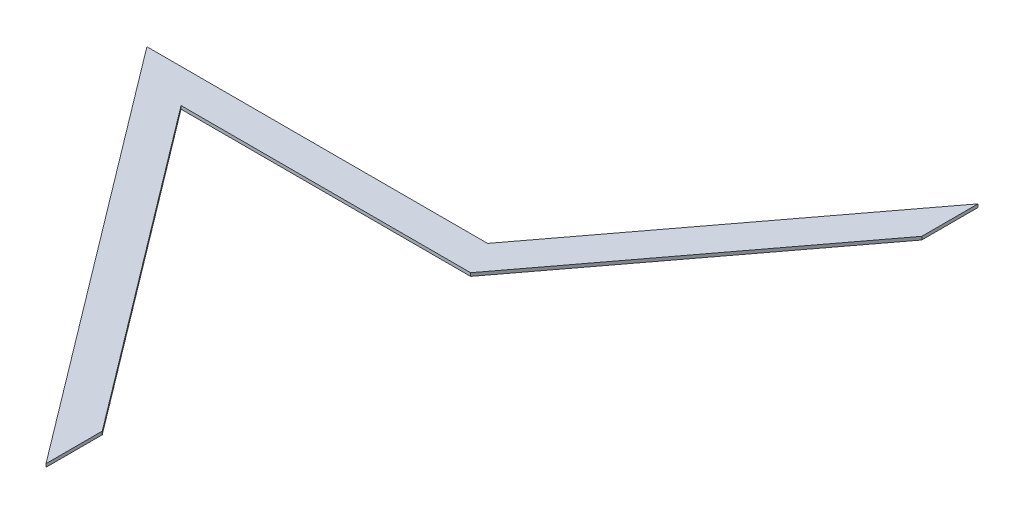
ISO-10303-21;
HEADER;
FILE_DESCRIPTION(('STEP AP214'),'2;1');
FILE_NAME('part.step','',(''),(''),'','','');
FILE_SCHEMA(('AUTOMOTIVE_DESIGN { 1 0 10303 214 1 1 1 1 }'));
ENDSEC;
DATA;
#1=APPLICATION_CONTEXT('core data for automotive mechanical design processes');
#2=APPLICATION_PROTOCOL_DEFINITION('international standard','automotive_design',2000,#1);
#3=PRODUCT_CONTEXT('',#1,'mechanical');
#4=PRODUCT('Part','Part','',(#3));
#5=PRODUCT_RELATED_PRODUCT_CATEGORY('part','',(#4));
#6=PRODUCT_DEFINITION_FORMATION('','',#4);
#7=PRODUCT_DEFINITION_CONTEXT('part definition',#1,'design');
#8=PRODUCT_DEFINITION('design','',#6,#7);
#9=PRODUCT_DEFINITION_SHAPE('','',#8);
#10=(LENGTH_UNIT() NAMED_UNIT(*) SI_UNIT(.MILLI.,.METRE.));
#11=(NAMED_UNIT(*) PLANE_ANGLE_UNIT() SI_UNIT($,.RADIAN.));
#12=(NAMED_UNIT(*) SI_UNIT($,.STERADIAN.) SOLID_ANGLE_UNIT());
#13=UNCERTAINTY_MEASURE_WITH_UNIT(LENGTH_MEASURE(1.E-05),#10,'distance_accuracy_value','');
#14=(GEOMETRIC_REPRESENTATION_CONTEXT(3) GLOBAL_UNCERTAINTY_ASSIGNED_CONTEXT((#13)) GLOBAL_UNIT_ASSIGNED_CONTEXT((#10,
#11,#12)) REPRESENTATION_CONTEXT('',''));
#15=CARTESIAN_POINT('',(0.,0.,0.));
#16=DIRECTION('',(0.,0.,1.));
#17=DIRECTION('',(1.,0.,0.));
#18=AXIS2_PLACEMENT_3D('',#15,#16,#17);
#19=CARTESIAN_POINT('',(74.9994366950103,1.,-214.999999990934));
#20=DIRECTION('',(0.798168151052773,0.,0.602434728949948));
#21=DIRECTION('',(0.602434728949948,0.,-0.798168151052773));
#22=AXIS2_PLACEMENT_3D('',#19,#20,#21);
#23=PLANE('',#22);
#24=DIRECTION('',(-0.602434728949948,0.,0.798168151052773));
#25=VECTOR('',#24,1.);
#26=CARTESIAN_POINT('',(74.9994366950103,0.,-214.999999990934));
#27=LINE('',#26,#25);
#28=CARTESIAN_POINT('',(74.9994366950103,0.,-214.999999990934));
#29=VERTEX_POINT('',#28);
#30=CARTESIAN_POINT('',(9.36449003004114,0.,-128.04));
#31=VERTEX_POINT('',#30);
#32=EDGE_CURVE('E129',#29,#31,#27,.T.);
#33=ORIENTED_EDGE('',*,*,#32,.T.);
#34=DIRECTION('',(0.,-1.,0.));
#35=VECTOR('',#34,1.);
#36=CARTESIAN_POINT('',(9.36449003004114,1.,-128.04));
#37=LINE('',#36,#35);
#38=CARTESIAN_POINT('',(9.36449003004114,1.,-128.04));
#39=VERTEX_POINT('',#38);
#40=EDGE_CURVE('E11',#39,#31,#37,.T.);
#41=ORIENTED_EDGE('',*,*,#40,.F.);
#42=DIRECTION('',(-0.602434728949948,0.,0.798168151052773));
#43=VECTOR('',#42,1.);
#44=CARTESIAN_POINT('',(74.9994366950103,1.,-214.999999990934));
#45=LINE('',#44,#43);
#46=CARTESIAN_POINT('',(74.9994366950103,1.,-214.999999990934));
#47=VERTEX_POINT('',#46);
#48=EDGE_CURVE('E143',#47,#39,#45,.T.);
#49=ORIENTED_EDGE('',*,*,#48,.F.);
#50=DIRECTION('',(0.,-1.,0.));
#51=VECTOR('',#50,1.);
#52=CARTESIAN_POINT('',(74.9994366950103,1.,-214.999999990934));
#53=LINE('',#52,#51);
#54=EDGE_CURVE('E125',#47,#29,#53,.T.);
#55=ORIENTED_EDGE('',*,*,#54,.T.);
#56=EDGE_LOOP('',(#33,#41,#49,#55));
#57=FACE_BOUND('',#56,.T.);
#58=ADVANCED_FACE('F33',(#57),#23,.F.);
#59=CARTESIAN_POINT('',(9.36449003004114,1.,-128.04));
#60=DIRECTION('',(0.,0.,1.));
#61=DIRECTION('',(1.,0.,0.));
#62=AXIS2_PLACEMENT_3D('',#59,#60,#61);
#63=PLANE('',#62);
#64=DIRECTION('',(-1.,0.,0.));
#65=VECTOR('',#64,1.);
#66=CARTESIAN_POINT('',(9.36449003004114,0.,-128.04));
#67=LINE('',#66,#65);
#68=CARTESIAN_POINT('',(-96.6474374713363,0.,-128.04));
#69=VERTEX_POINT('',#68);
#70=EDGE_CURVE('E132',#31,#69,#67,.T.);
#71=ORIENTED_EDGE('',*,*,#70,.T.);
#72=DIRECTION('',(0.,-1.,0.));
#73=VECTOR('',#72,1.);
#74=CARTESIAN_POINT('',(-96.6474374713363,1.,-128.04));
#75=LINE('',#74,#73);
#76=CARTESIAN_POINT('',(-96.6474374713363,1.,-128.04));
#77=VERTEX_POINT('',#76);
#78=EDGE_CURVE('E41',#77,#69,#75,.T.);
#79=ORIENTED_EDGE('',*,*,#78,.F.);
#80=DIRECTION('',(-1.,0.,0.));
#81=VECTOR('',#80,1.);
#82=CARTESIAN_POINT('',(9.36449003004114,1.,-128.04));
#83=LINE('',#82,#81);
#84=EDGE_CURVE('E92',#39,#77,#83,.T.);
#85=ORIENTED_EDGE('',*,*,#84,.F.);
#86=ORIENTED_EDGE('',*,*,#40,.T.);
#87=EDGE_LOOP('',(#71,#79,#85,#86));
#88=FACE_BOUND('',#87,.T.);
#89=ADVANCED_FACE('F178',(#88),#63,.F.);
#90=CARTESIAN_POINT('',(-96.6474374713363,1.,-128.04));
#91=DIRECTION('',(0.798148758954199,0.,-0.602460420757972));
#92=DIRECTION('',(-0.602460420757972,0.,-0.798148758954199));
#93=AXIS2_PLACEMENT_3D('',#90,#91,#92);
#94=PLANE('',#93);
#95=DIRECTION('',(0.602460420757971,0.,0.798148758954199));
#96=VECTOR('',#95,1.);
#97=CARTESIAN_POINT('',(-96.6474374713363,0.,-128.04));
#98=LINE('',#97,#96);
#99=CARTESIAN_POINT('',(0.,0.,0.));
#100=VERTEX_POINT('',#99);
#101=EDGE_CURVE('E134',#69,#100,#98,.T.);
#102=ORIENTED_EDGE('',*,*,#101,.T.);
#103=DIRECTION('',(0.,-1.,0.));
#104=VECTOR('',#103,1.);
#105=CARTESIAN_POINT('',(0.,1.,0.));
#106=LINE('',#105,#104);
#107=CARTESIAN_POINT('',(0.,1.,0.));
#108=VERTEX_POINT('',#107);
#109=EDGE_CURVE('E150',#108,#100,#106,.T.);
#110=ORIENTED_EDGE('',*,*,#109,.F.);
#111=DIRECTION('',(0.602460420757971,0.,0.798148758954199));
#112=VECTOR('',#111,1.);
#113=CARTESIAN_POINT('',(-96.6474374713363,1.,-128.04));
#114=LINE('',#113,#112);
#115=EDGE_CURVE('E158',#77,#108,#114,.T.);
#116=ORIENTED_EDGE('',*,*,#115,.F.);
#117=ORIENTED_EDGE('',*,*,#78,.T.);
#118=EDGE_LOOP('',(#102,#110,#116,#117));
#119=FACE_BOUND('',#118,.T.);
#120=ADVANCED_FACE('F156',(#119),#94,.F.);
#121=CARTESIAN_POINT('',(0.,1.,0.));
#122=DIRECTION('',(-1.,0.,0.));
#123=DIRECTION('',(0.,0.,1.));
#124=AXIS2_PLACEMENT_3D('',#121,#122,#123);
#125=PLANE('',#124);
#126=DIRECTION('',(0.,0.,-1.));
#127=VECTOR('',#126,1.);
#128=CARTESIAN_POINT('',(0.,0.,0.));
#129=LINE('',#128,#127);
#130=CARTESIAN_POINT('',(0.,0.,-17.5));
#131=VERTEX_POINT('',#130);
#132=EDGE_CURVE('E136',#100,#131,#129,.T.);
#133=ORIENTED_EDGE('',*,*,#132,.T.);
#134=DIRECTION('',(0.,-1.,0.));
#135=VECTOR('',#134,1.);
#136=CARTESIAN_POINT('',(0.,1.,-17.5));
#137=LINE('',#136,#135);
#138=CARTESIAN_POINT('',(0.,1.,-17.5));
#139=VERTEX_POINT('',#138);
#140=EDGE_CURVE('E147',#139,#131,#137,.T.);
#141=ORIENTED_EDGE('',*,*,#140,.F.);
#142=DIRECTION('',(0.,0.,-1.));
#143=VECTOR('',#142,1.);
#144=CARTESIAN_POINT('',(0.,1.,0.));
#145=LINE('',#144,#143);
#146=EDGE_CURVE('E170',#108,#139,#145,.T.);
#147=ORIENTED_EDGE('',*,*,#146,.F.);
#148=ORIENTED_EDGE('',*,*,#109,.T.);
#149=EDGE_LOOP('',(#133,#141,#147,#148));
#150=FACE_BOUND('',#149,.T.);
#151=ADVANCED_FACE('F166',(#150),#125,.F.);
#152=CARTESIAN_POINT('',(0.,1.,-17.5));
#153=DIRECTION('',(-0.798148758954199,0.,0.602460420757972));
#154=DIRECTION('',(0.602460420757972,0.,0.798148758954199));
#155=AXIS2_PLACEMENT_3D('',#152,#153,#154);
#156=PLANE('',#155);
#157=DIRECTION('',(-0.602460420757972,0.,-0.798148758954199));
#158=VECTOR('',#157,1.);
#159=CARTESIAN_POINT('',(0.,0.,-17.5));
#160=LINE('',#159,#158);
#161=CARTESIAN_POINT('',(-75.4822223300035,0.,-117.5));
#162=VERTEX_POINT('',#161);
#163=EDGE_CURVE('E138',#131,#162,#160,.T.);
#164=ORIENTED_EDGE('',*,*,#163,.T.);
#165=DIRECTION('',(0.,-1.,0.));
#166=VECTOR('',#165,1.);
#167=CARTESIAN_POINT('',(-75.4822223300035,1.,-117.5));
#168=LINE('',#167,#166);
#169=CARTESIAN_POINT('',(-75.4822223300035,1.,-117.5));
#170=VERTEX_POINT('',#169);
#171=EDGE_CURVE('E120',#170,#162,#168,.T.);
#172=ORIENTED_EDGE('',*,*,#171,.F.);
#173=DIRECTION('',(-0.602460420757972,0.,-0.798148758954199));
#174=VECTOR('',#173,1.);
#175=CARTESIAN_POINT('',(0.,1.,-17.5));
#176=LINE('',#175,#174);
#177=EDGE_CURVE('E111',#139,#170,#176,.T.);
#178=ORIENTED_EDGE('',*,*,#177,.F.);
#179=ORIENTED_EDGE('',*,*,#140,.T.);
#180=EDGE_LOOP('',(#164,#172,#178,#179));
#181=FACE_BOUND('',#180,.T.);
#182=ADVANCED_FACE('F169',(#181),#156,.F.);
#183=CARTESIAN_POINT('',(-75.4822223300035,1.,-117.5));
#184=DIRECTION('',(0.,0.,-1.));
#185=DIRECTION('',(-1.,0.,0.));
#186=AXIS2_PLACEMENT_3D('',#183,#184,#185);
#187=PLANE('',#186);
#188=DIRECTION('',(1.,0.,0.));
#189=VECTOR('',#188,1.);
#190=CARTESIAN_POINT('',(-75.4822223300035,0.,-117.5));
#191=LINE('',#190,#189);
#192=CARTESIAN_POINT('',(14.6182643313598,0.,-117.5));
#193=VERTEX_POINT('',#192);
#194=EDGE_CURVE('E119',#162,#193,#191,.T.);
#195=ORIENTED_EDGE('',*,*,#194,.T.);
#196=DIRECTION('',(0.,-1.,0.));
#197=VECTOR('',#196,1.);
#198=CARTESIAN_POINT('',(14.6182643313598,1.,-117.5));
#199=LINE('',#198,#197);
#200=CARTESIAN_POINT('',(14.6182643313598,1.,-117.5));
#201=VERTEX_POINT('',#200);
#202=EDGE_CURVE('E116',#201,#193,#199,.T.);
#203=ORIENTED_EDGE('',*,*,#202,.F.);
#204=DIRECTION('',(1.,0.,0.));
#205=VECTOR('',#204,1.);
#206=CARTESIAN_POINT('',(-75.4822223300035,1.,-117.5));
#207=LINE('',#206,#205);
#208=EDGE_CURVE('E105',#170,#201,#207,.T.);
#209=ORIENTED_EDGE('',*,*,#208,.F.);
#210=ORIENTED_EDGE('',*,*,#171,.T.);
#211=EDGE_LOOP('',(#195,#203,#209,#210));
#212=FACE_BOUND('',#211,.T.);
#213=ADVANCED_FACE('F117',(#212),#187,.F.);
#214=CARTESIAN_POINT('',(14.6182643313598,1.,-117.5));
#215=DIRECTION('',(-0.798168151052773,0.,-0.602434728949948));
#216=DIRECTION('',(-0.602434728949948,0.,0.798168151052773));
#217=AXIS2_PLACEMENT_3D('',#214,#215,#216);
#218=PLANE('',#217);
#219=DIRECTION('',(0.602434728949948,0.,-0.798168151052773));
#220=VECTOR('',#219,1.);
#221=CARTESIAN_POINT('',(14.6182643313598,0.,-117.5));
#222=LINE('',#221,#220);
#223=CARTESIAN_POINT('',(75.,0.,-197.5));
#224=VERTEX_POINT('',#223);
#225=EDGE_CURVE('E78',#193,#224,#222,.T.);
#226=ORIENTED_EDGE('',*,*,#225,.T.);
#227=DIRECTION('',(0.,-1.,0.));
#228=VECTOR('',#227,1.);
#229=CARTESIAN_POINT('',(75.,1.,-197.5));
#230=LINE('',#229,#228);
#231=CARTESIAN_POINT('',(75.,1.,-197.5));
#232=VERTEX_POINT('',#231);
#233=EDGE_CURVE('E121',#232,#224,#230,.T.);
#234=ORIENTED_EDGE('',*,*,#233,.F.);
#235=DIRECTION('',(0.602434728949948,0.,-0.798168151052773));
#236=VECTOR('',#235,1.);
#237=CARTESIAN_POINT('',(14.6182643313598,1.,-117.5));
#238=LINE('',#237,#236);
#239=EDGE_CURVE('E109',#201,#232,#238,.T.);
#240=ORIENTED_EDGE('',*,*,#239,.F.);
#241=ORIENTED_EDGE('',*,*,#202,.T.);
#242=EDGE_LOOP('',(#226,#234,#240,#241));
#243=FACE_BOUND('',#242,.T.);
#244=ADVANCED_FACE('F123',(#243),#218,.F.);
#245=CARTESIAN_POINT('',(74.9994366950103,1.,-214.999999990934));
#246=DIRECTION('',(-0.999999999481939,0.,3.21888565571867E-05));
#247=DIRECTION('',(3.21888565571867E-05,0.,0.999999999481939));
#248=AXIS2_PLACEMENT_3D('',#245,#246,#247);
#249=PLANE('',#248);
#250=DIRECTION('',(-3.21888565571867E-05,0.,-0.999999999481939));
#251=VECTOR('',#250,1.);
#252=CARTESIAN_POINT('',(74.9994366950103,0.,-214.999999990934));
#253=LINE('',#252,#251);
#254=EDGE_CURVE('E84',#224,#29,#253,.T.);
#255=ORIENTED_EDGE('',*,*,#254,.T.);
#256=ORIENTED_EDGE('',*,*,#54,.F.);
#257=DIRECTION('',(-3.21888565571867E-05,0.,-0.999999999481939));
#258=VECTOR('',#257,1.);
#259=CARTESIAN_POINT('',(74.9994366950103,1.,-214.999999990934));
#260=LINE('',#259,#258);
#261=EDGE_CURVE('E49',#232,#47,#260,.T.);
#262=ORIENTED_EDGE('',*,*,#261,.F.);
#263=ORIENTED_EDGE('',*,*,#233,.T.);
#264=EDGE_LOOP('',(#255,#256,#262,#263));
#265=FACE_BOUND('',#264,.T.);
#266=ADVANCED_FACE('F194',(#265),#249,.F.);
#267=CARTESIAN_POINT('',(0.,1.,0.));
#268=DIRECTION('',(0.,1.,0.));
#269=DIRECTION('',(0.,0.,1.));
#270=AXIS2_PLACEMENT_3D('',#267,#268,#269);
#271=PLANE('',#270);
#272=ORIENTED_EDGE('',*,*,#48,.T.);
#273=ORIENTED_EDGE('',*,*,#84,.T.);
#274=ORIENTED_EDGE('',*,*,#115,.T.);
#275=ORIENTED_EDGE('',*,*,#146,.T.);
#276=ORIENTED_EDGE('',*,*,#177,.T.);
#277=ORIENTED_EDGE('',*,*,#208,.T.);
#278=ORIENTED_EDGE('',*,*,#239,.T.);
#279=ORIENTED_EDGE('',*,*,#261,.T.);
#280=EDGE_LOOP('',(#272,#273,#274,#275,#276,#277,#278,#279));
#281=FACE_BOUND('',#280,.T.);
#282=ADVANCED_FACE('F107',(#281),#271,.T.);
#283=CARTESIAN_POINT('',(0.,0.,0.));
#284=DIRECTION('',(0.,1.,0.));
#285=DIRECTION('',(0.,0.,1.));
#286=AXIS2_PLACEMENT_3D('',#283,#284,#285);
#287=PLANE('',#286);
#288=ORIENTED_EDGE('',*,*,#32,.F.);
#289=ORIENTED_EDGE('',*,*,#254,.F.);
#290=ORIENTED_EDGE('',*,*,#225,.F.);
#291=ORIENTED_EDGE('',*,*,#194,.F.);
#292=ORIENTED_EDGE('',*,*,#163,.F.);
#293=ORIENTED_EDGE('',*,*,#132,.F.);
#294=ORIENTED_EDGE('',*,*,#101,.F.);
#295=ORIENTED_EDGE('',*,*,#70,.F.);
#296=EDGE_LOOP('',(#288,#289,#290,#291,#292,#293,#294,#295));
#297=FACE_BOUND('',#296,.T.);
#298=ADVANCED_FACE('F162',(#297),#287,.F.);
#299=CLOSED_SHELL('',(#58,#89,#120,#151,#182,#213,#244,#266,#282,#298));
#300=MANIFOLD_SOLID_BREP('B2',#299);
#301=ADVANCED_BREP_SHAPE_REPRESENTATION('',(#18,#300),#14);
#302=SHAPE_DEFINITION_REPRESENTATION(#9,#301);
ENDSEC;
END-ISO-10303-21;
